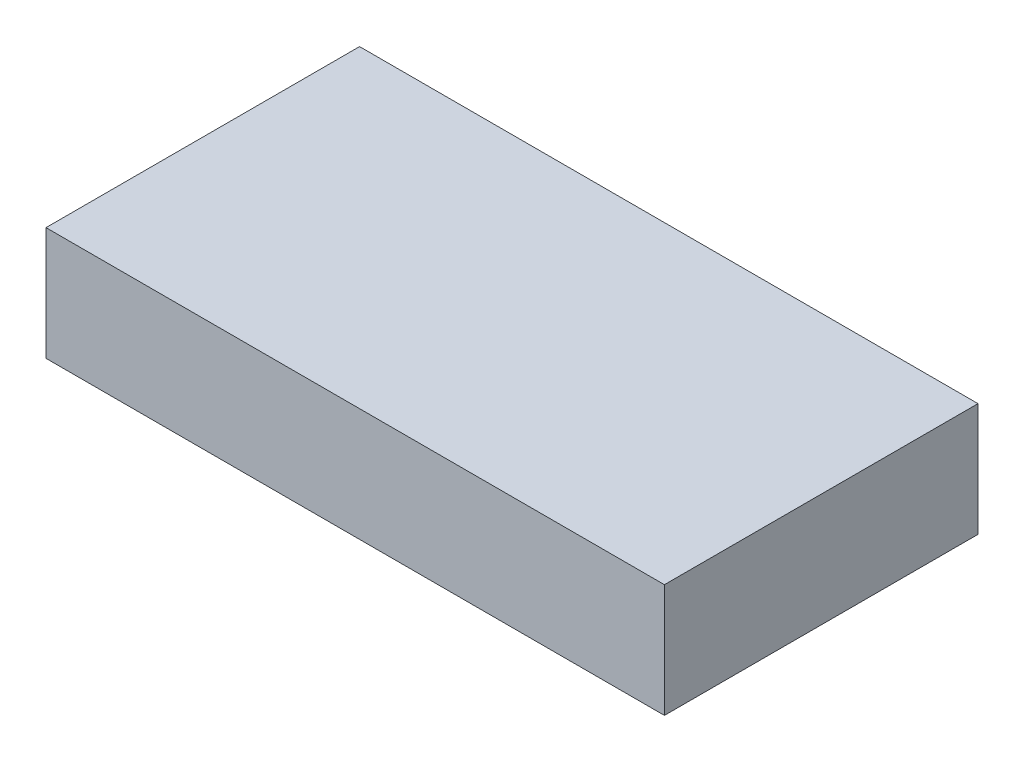
ISO-10303-21;
HEADER;
FILE_DESCRIPTION(('STEP AP214'),'2;1');
FILE_NAME('part.step','',(''),(''),'','','');
FILE_SCHEMA(('AUTOMOTIVE_DESIGN { 1 0 10303 214 1 1 1 1 }'));
ENDSEC;
DATA;
#1=APPLICATION_CONTEXT('core data for automotive mechanical design processes');
#2=APPLICATION_PROTOCOL_DEFINITION('international standard','automotive_design',2000,#1);
#3=PRODUCT_CONTEXT('',#1,'mechanical');
#4=PRODUCT('Part','Part','',(#3));
#5=PRODUCT_RELATED_PRODUCT_CATEGORY('part','',(#4));
#6=PRODUCT_DEFINITION_FORMATION('','',#4);
#7=PRODUCT_DEFINITION_CONTEXT('part definition',#1,'design');
#8=PRODUCT_DEFINITION('design','',#6,#7);
#9=PRODUCT_DEFINITION_SHAPE('','',#8);
#10=(LENGTH_UNIT() NAMED_UNIT(*) SI_UNIT(.MILLI.,.METRE.));
#11=(NAMED_UNIT(*) PLANE_ANGLE_UNIT() SI_UNIT($,.RADIAN.));
#12=(NAMED_UNIT(*) SI_UNIT($,.STERADIAN.) SOLID_ANGLE_UNIT());
#13=UNCERTAINTY_MEASURE_WITH_UNIT(LENGTH_MEASURE(1.E-05),#10,'distance_accuracy_value','');
#14=(GEOMETRIC_REPRESENTATION_CONTEXT(3) GLOBAL_UNCERTAINTY_ASSIGNED_CONTEXT((#13)) GLOBAL_UNIT_ASSIGNED_CONTEXT((#10,
#11,#12)) REPRESENTATION_CONTEXT('',''));
#15=CARTESIAN_POINT('',(0.,0.,0.));
#16=DIRECTION('',(0.,0.,1.));
#17=DIRECTION('',(1.,0.,0.));
#18=AXIS2_PLACEMENT_3D('',#15,#16,#17);
#19=CARTESIAN_POINT('',(35.5,6.5,-18.));
#20=DIRECTION('',(-1.,0.,0.));
#21=DIRECTION('',(0.,0.,1.));
#22=AXIS2_PLACEMENT_3D('',#19,#20,#21);
#23=PLANE('',#22);
#24=DIRECTION('',(0.,0.,-1.));
#25=VECTOR('',#24,1.);
#26=CARTESIAN_POINT('',(35.5,-6.5,-18.));
#27=LINE('',#26,#25);
#28=CARTESIAN_POINT('',(35.5,-6.5,18.));
#29=VERTEX_POINT('',#28);
#30=CARTESIAN_POINT('',(35.5,-6.5,-18.));
#31=VERTEX_POINT('',#30);
#32=EDGE_CURVE('E96',#29,#31,#27,.T.);
#33=ORIENTED_EDGE('',*,*,#32,.T.);
#34=DIRECTION('',(0.,-1.,0.));
#35=VECTOR('',#34,1.);
#36=CARTESIAN_POINT('',(35.5,6.5,-18.));
#37=LINE('',#36,#35);
#38=CARTESIAN_POINT('',(35.5,6.5,-18.));
#39=VERTEX_POINT('',#38);
#40=EDGE_CURVE('E11',#39,#31,#37,.T.);
#41=ORIENTED_EDGE('',*,*,#40,.F.);
#42=DIRECTION('',(0.,0.,-1.));
#43=VECTOR('',#42,1.);
#44=CARTESIAN_POINT('',(35.5,6.5,-18.));
#45=LINE('',#44,#43);
#46=CARTESIAN_POINT('',(35.5,6.5,18.));
#47=VERTEX_POINT('',#46);
#48=EDGE_CURVE('E84',#47,#39,#45,.T.);
#49=ORIENTED_EDGE('',*,*,#48,.F.);
#50=DIRECTION('',(0.,-1.,0.));
#51=VECTOR('',#50,1.);
#52=CARTESIAN_POINT('',(35.5,6.5,18.));
#53=LINE('',#52,#51);
#54=EDGE_CURVE('E92',#47,#29,#53,.T.);
#55=ORIENTED_EDGE('',*,*,#54,.T.);
#56=EDGE_LOOP('',(#33,#41,#49,#55));
#57=FACE_BOUND('',#56,.T.);
#58=ADVANCED_FACE('F33',(#57),#23,.F.);
#59=CARTESIAN_POINT('',(-35.5,6.5,-18.));
#60=DIRECTION('',(0.,0.,1.));
#61=DIRECTION('',(1.,0.,0.));
#62=AXIS2_PLACEMENT_3D('',#59,#60,#61);
#63=PLANE('',#62);
#64=DIRECTION('',(-1.,0.,0.));
#65=VECTOR('',#64,1.);
#66=CARTESIAN_POINT('',(-35.5,-6.5,-18.));
#67=LINE('',#66,#65);
#68=CARTESIAN_POINT('',(-35.5,-6.5,-18.));
#69=VERTEX_POINT('',#68);
#70=EDGE_CURVE('E88',#31,#69,#67,.T.);
#71=ORIENTED_EDGE('',*,*,#70,.T.);
#72=DIRECTION('',(0.,-1.,0.));
#73=VECTOR('',#72,1.);
#74=CARTESIAN_POINT('',(-35.5,6.5,-18.));
#75=LINE('',#74,#73);
#76=CARTESIAN_POINT('',(-35.5,6.5,-18.));
#77=VERTEX_POINT('',#76);
#78=EDGE_CURVE('E41',#77,#69,#75,.T.);
#79=ORIENTED_EDGE('',*,*,#78,.F.);
#80=DIRECTION('',(-1.,0.,0.));
#81=VECTOR('',#80,1.);
#82=CARTESIAN_POINT('',(-35.5,6.5,-18.));
#83=LINE('',#82,#81);
#84=EDGE_CURVE('E79',#39,#77,#83,.T.);
#85=ORIENTED_EDGE('',*,*,#84,.F.);
#86=ORIENTED_EDGE('',*,*,#40,.T.);
#87=EDGE_LOOP('',(#71,#79,#85,#86));
#88=FACE_BOUND('',#87,.T.);
#89=ADVANCED_FACE('F87',(#88),#63,.F.);
#90=CARTESIAN_POINT('',(-35.5,6.5,-18.));
#91=DIRECTION('',(1.,0.,0.));
#92=DIRECTION('',(0.,0.,-1.));
#93=AXIS2_PLACEMENT_3D('',#90,#91,#92);
#94=PLANE('',#93);
#95=DIRECTION('',(0.,0.,1.));
#96=VECTOR('',#95,1.);
#97=CARTESIAN_POINT('',(-35.5,-6.5,-18.));
#98=LINE('',#97,#96);
#99=CARTESIAN_POINT('',(-35.5,-6.5,18.));
#100=VERTEX_POINT('',#99);
#101=EDGE_CURVE('E66',#69,#100,#98,.T.);
#102=ORIENTED_EDGE('',*,*,#101,.T.);
#103=DIRECTION('',(0.,-1.,0.));
#104=VECTOR('',#103,1.);
#105=CARTESIAN_POINT('',(-35.5,6.5,18.));
#106=LINE('',#105,#104);
#107=CARTESIAN_POINT('',(-35.5,6.5,18.));
#108=VERTEX_POINT('',#107);
#109=EDGE_CURVE('E89',#108,#100,#106,.T.);
#110=ORIENTED_EDGE('',*,*,#109,.F.);
#111=DIRECTION('',(0.,0.,1.));
#112=VECTOR('',#111,1.);
#113=CARTESIAN_POINT('',(-35.5,6.5,-18.));
#114=LINE('',#113,#112);
#115=EDGE_CURVE('E82',#77,#108,#114,.T.);
#116=ORIENTED_EDGE('',*,*,#115,.F.);
#117=ORIENTED_EDGE('',*,*,#78,.T.);
#118=EDGE_LOOP('',(#102,#110,#116,#117));
#119=FACE_BOUND('',#118,.T.);
#120=ADVANCED_FACE('F90',(#119),#94,.F.);
#121=CARTESIAN_POINT('',(-35.5,6.5,18.));
#122=DIRECTION('',(0.,0.,-1.));
#123=DIRECTION('',(-1.,0.,0.));
#124=AXIS2_PLACEMENT_3D('',#121,#122,#123);
#125=PLANE('',#124);
#126=DIRECTION('',(1.,0.,0.));
#127=VECTOR('',#126,1.);
#128=CARTESIAN_POINT('',(-35.5,-6.5,18.));
#129=LINE('',#128,#127);
#130=EDGE_CURVE('E72',#100,#29,#129,.T.);
#131=ORIENTED_EDGE('',*,*,#130,.T.);
#132=ORIENTED_EDGE('',*,*,#54,.F.);
#133=DIRECTION('',(1.,0.,0.));
#134=VECTOR('',#133,1.);
#135=CARTESIAN_POINT('',(-35.5,6.5,18.));
#136=LINE('',#135,#134);
#137=EDGE_CURVE('E49',#108,#47,#136,.T.);
#138=ORIENTED_EDGE('',*,*,#137,.F.);
#139=ORIENTED_EDGE('',*,*,#109,.T.);
#140=EDGE_LOOP('',(#131,#132,#138,#139));
#141=FACE_BOUND('',#140,.T.);
#142=ADVANCED_FACE('F103',(#141),#125,.F.);
#143=CARTESIAN_POINT('',(0.,6.5,0.));
#144=DIRECTION('',(0.,1.,0.));
#145=DIRECTION('',(0.,0.,1.));
#146=AXIS2_PLACEMENT_3D('',#143,#144,#145);
#147=PLANE('',#146);
#148=ORIENTED_EDGE('',*,*,#48,.T.);
#149=ORIENTED_EDGE('',*,*,#84,.T.);
#150=ORIENTED_EDGE('',*,*,#115,.T.);
#151=ORIENTED_EDGE('',*,*,#137,.T.);
#152=EDGE_LOOP('',(#148,#149,#150,#151));
#153=FACE_BOUND('',#152,.T.);
#154=ADVANCED_FACE('F80',(#153),#147,.T.);
#155=CARTESIAN_POINT('',(0.,-6.5,0.));
#156=DIRECTION('',(0.,1.,0.));
#157=DIRECTION('',(0.,0.,1.));
#158=AXIS2_PLACEMENT_3D('',#155,#156,#157);
#159=PLANE('',#158);
#160=ORIENTED_EDGE('',*,*,#32,.F.);
#161=ORIENTED_EDGE('',*,*,#130,.F.);
#162=ORIENTED_EDGE('',*,*,#101,.F.);
#163=ORIENTED_EDGE('',*,*,#70,.F.);
#164=EDGE_LOOP('',(#160,#161,#162,#163));
#165=FACE_BOUND('',#164,.T.);
#166=ADVANCED_FACE('F106',(#165),#159,.F.);
#167=CLOSED_SHELL('',(#58,#89,#120,#142,#154,#166));
#168=MANIFOLD_SOLID_BREP('B2',#167);
#169=ADVANCED_BREP_SHAPE_REPRESENTATION('',(#18,#168),#14);
#170=SHAPE_DEFINITION_REPRESENTATION(#9,#169);
ENDSEC;
END-ISO-10303-21;
